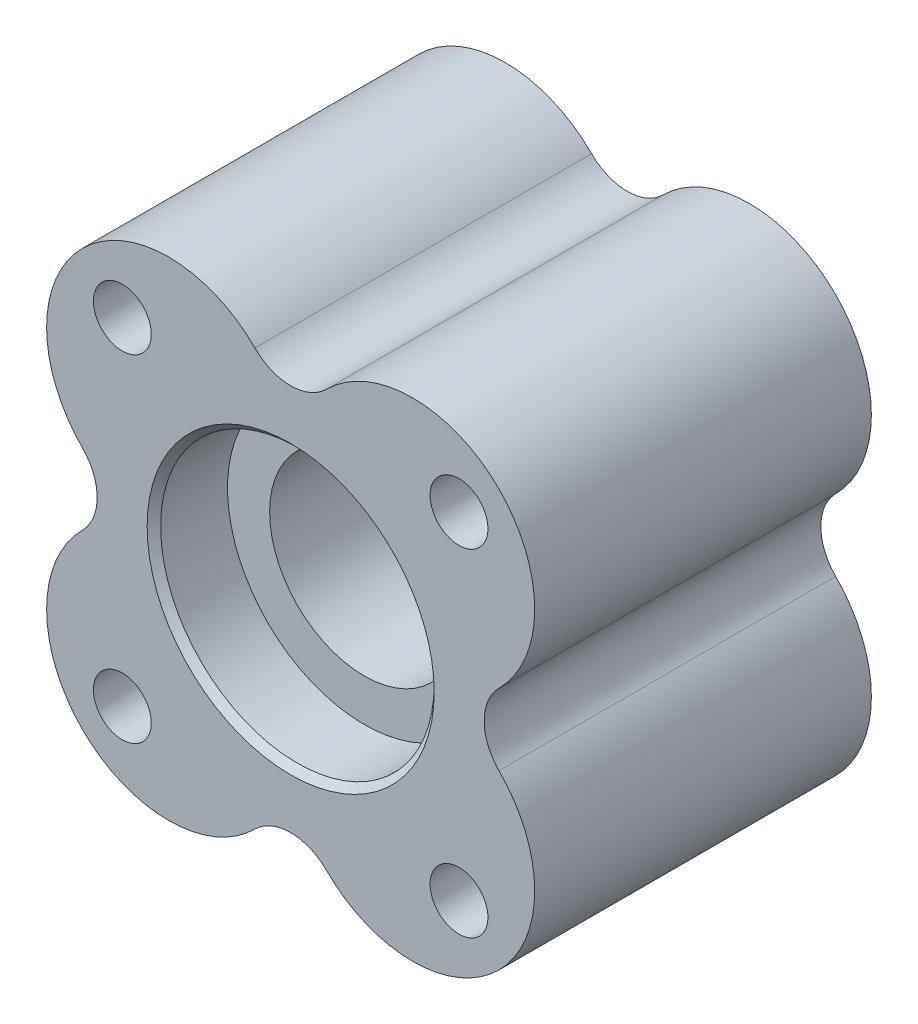
ISO-10303-21;
HEADER;
FILE_DESCRIPTION(('STEP AP214'),'2;1');
FILE_NAME('part.step','',(''),(''),'','','');
FILE_SCHEMA(('AUTOMOTIVE_DESIGN { 1 0 10303 214 1 1 1 1 }'));
ENDSEC;
DATA;
#1=APPLICATION_CONTEXT('core data for automotive mechanical design processes');
#2=APPLICATION_PROTOCOL_DEFINITION('international standard','automotive_design',2000,#1);
#3=PRODUCT_CONTEXT('',#1,'mechanical');
#4=PRODUCT('Part','Part','',(#3));
#5=PRODUCT_RELATED_PRODUCT_CATEGORY('part','',(#4));
#6=PRODUCT_DEFINITION_FORMATION('','',#4);
#7=PRODUCT_DEFINITION_CONTEXT('part definition',#1,'design');
#8=PRODUCT_DEFINITION('design','',#6,#7);
#9=PRODUCT_DEFINITION_SHAPE('','',#8);
#10=(LENGTH_UNIT() NAMED_UNIT(*) SI_UNIT(.MILLI.,.METRE.));
#11=(NAMED_UNIT(*) PLANE_ANGLE_UNIT() SI_UNIT($,.RADIAN.));
#12=(NAMED_UNIT(*) SI_UNIT($,.STERADIAN.) SOLID_ANGLE_UNIT());
#13=UNCERTAINTY_MEASURE_WITH_UNIT(LENGTH_MEASURE(1.E-05),#10,'distance_accuracy_value','');
#14=(GEOMETRIC_REPRESENTATION_CONTEXT(3) GLOBAL_UNCERTAINTY_ASSIGNED_CONTEXT((#13)) GLOBAL_UNIT_ASSIGNED_CONTEXT((#10,
#11,#12)) REPRESENTATION_CONTEXT('',''));
#15=CARTESIAN_POINT('',(0.,0.,0.));
#16=DIRECTION('',(0.,0.,1.));
#17=DIRECTION('',(1.,0.,0.));
#18=AXIS2_PLACEMENT_3D('',#15,#16,#17);
#19=CARTESIAN_POINT('',(0.,0.,-25.4));
#20=DIRECTION('',(0.,0.,1.));
#21=DIRECTION('',(1.,0.,0.));
#22=AXIS2_PLACEMENT_3D('',#19,#20,#21);
#23=PLANE('',#22);
#24=CARTESIAN_POINT('',(25.4,25.4,-25.4));
#25=DIRECTION('',(0.,0.,-1.));
#26=DIRECTION('',(-1.,0.,0.));
#27=AXIS2_PLACEMENT_3D('',#24,#25,#26);
#28=CIRCLE('',#27,8.0645);
#29=CARTESIAN_POINT('',(17.3355,25.4,-25.4));
#30=VERTEX_POINT('',#29);
#31=EDGE_CURVE('E311',#30,#30,#28,.T.);
#32=ORIENTED_EDGE('',*,*,#31,.F.);
#33=EDGE_LOOP('',(#32));
#34=FACE_BOUND('',#33,.T.);
#35=CARTESIAN_POINT('',(-25.4,-25.4,-25.4));
#36=DIRECTION('',(0.,0.,-1.));
#37=DIRECTION('',(-1.,0.,0.));
#38=AXIS2_PLACEMENT_3D('',#35,#36,#37);
#39=CIRCLE('',#38,8.0645);
#40=CARTESIAN_POINT('',(-33.4645,-25.4,-25.4));
#41=VERTEX_POINT('',#40);
#42=EDGE_CURVE('E329',#41,#41,#39,.T.);
#43=ORIENTED_EDGE('',*,*,#42,.F.);
#44=EDGE_LOOP('',(#43));
#45=FACE_BOUND('',#44,.T.);
#46=CARTESIAN_POINT('',(0.,0.,-25.4));
#47=DIRECTION('',(0.,0.,1.));
#48=DIRECTION('',(1.,0.,0.));
#49=AXIS2_PLACEMENT_3D('',#46,#47,#48);
#50=CIRCLE('',#49,21.6535);
#51=CARTESIAN_POINT('',(21.6535,0.,-25.4));
#52=VERTEX_POINT('',#51);
#53=EDGE_CURVE('E48',#52,#52,#50,.T.);
#54=ORIENTED_EDGE('',*,*,#53,.T.);
#55=EDGE_LOOP('',(#54));
#56=FACE_BOUND('',#55,.T.);
#57=CARTESIAN_POINT('',(18.4117928474843,-18.4117928474839,-25.4));
#58=DIRECTION('',(0.,0.,1.));
#59=DIRECTION('',(0.,1.,0.));
#60=AXIS2_PLACEMENT_3D('',#57,#58,#59);
#61=CIRCLE('',#60,18.4117928474841);
#62=CARTESIAN_POINT('',(5.39268927122611,-31.430896423742,-25.4));
#63=VERTEX_POINT('',#62);
#64=CARTESIAN_POINT('',(31.4308964237421,-5.39268927122578,-25.4));
#65=VERTEX_POINT('',#64);
#66=EDGE_CURVE('E156',#63,#65,#61,.T.);
#67=ORIENTED_EDGE('',*,*,#66,.F.);
#68=CARTESIAN_POINT('',(0.,-36.8235856949681,-25.4));
#69=DIRECTION('',(0.,0.,-1.));
#70=DIRECTION('',(1.,0.,0.));
#71=AXIS2_PLACEMENT_3D('',#68,#69,#70);
#72=CIRCLE('',#71,7.62641430503184);
#73=CARTESIAN_POINT('',(-5.39268927122611,-31.430896423742,-25.4));
#74=VERTEX_POINT('',#73);
#75=EDGE_CURVE('E126',#74,#63,#72,.T.);
#76=ORIENTED_EDGE('',*,*,#75,.F.);
#77=CARTESIAN_POINT('',(-18.411792847484,-18.4117928474841,-25.4));
#78=DIRECTION('',(0.,0.,1.));
#79=DIRECTION('',(0.,1.,0.));
#80=AXIS2_PLACEMENT_3D('',#77,#78,#79);
#81=CIRCLE('',#80,18.4117928474841);
#82=CARTESIAN_POINT('',(-31.430896423742,-5.39268927122622,-25.4));
#83=VERTEX_POINT('',#82);
#84=EDGE_CURVE('E148',#83,#74,#81,.T.);
#85=ORIENTED_EDGE('',*,*,#84,.F.);
#86=CARTESIAN_POINT('',(-36.8235856949681,-1.28568862283272E-13,-25.4));
#87=DIRECTION('',(0.,0.,-1.));
#88=DIRECTION('',(0.,-1.,0.));
#89=AXIS2_PLACEMENT_3D('',#86,#87,#88);
#90=CIRCLE('',#89,7.62641430503184);
#91=CARTESIAN_POINT('',(-31.430896423742,5.392689271226,-25.4));
#92=VERTEX_POINT('',#91);
#93=EDGE_CURVE('E145',#92,#83,#90,.T.);
#94=ORIENTED_EDGE('',*,*,#93,.F.);
#95=CARTESIAN_POINT('',(-18.4117928474841,18.4117928474841,-25.4));
#96=DIRECTION('',(0.,0.,1.));
#97=DIRECTION('',(1.,0.,0.));
#98=AXIS2_PLACEMENT_3D('',#95,#96,#97);
#99=CIRCLE('',#98,18.4117928474841);
#100=CARTESIAN_POINT('',(-5.39268927122611,31.430896423742,-25.4));
#101=VERTEX_POINT('',#100);
#102=EDGE_CURVE('E172',#101,#92,#99,.T.);
#103=ORIENTED_EDGE('',*,*,#102,.F.);
#104=CARTESIAN_POINT('',(0.,36.8235856949681,-25.4));
#105=DIRECTION('',(0.,0.,-1.));
#106=DIRECTION('',(-1.,0.,0.));
#107=AXIS2_PLACEMENT_3D('',#104,#105,#106);
#108=CIRCLE('',#107,7.62641430503184);
#109=CARTESIAN_POINT('',(5.39268927122611,31.430896423742,-25.4));
#110=VERTEX_POINT('',#109);
#111=EDGE_CURVE('E170',#110,#101,#108,.T.);
#112=ORIENTED_EDGE('',*,*,#111,.F.);
#113=CARTESIAN_POINT('',(18.4117928474841,18.4117928474841,-25.4));
#114=DIRECTION('',(0.,0.,1.));
#115=DIRECTION('',(-1.,0.,0.));
#116=AXIS2_PLACEMENT_3D('',#113,#114,#115);
#117=CIRCLE('',#116,18.4117928474841);
#118=CARTESIAN_POINT('',(31.4308964237419,5.39268927122644,-25.4));
#119=VERTEX_POINT('',#118);
#120=EDGE_CURVE('E167',#119,#110,#117,.T.);
#121=ORIENTED_EDGE('',*,*,#120,.F.);
#122=CARTESIAN_POINT('',(36.8235856949681,3.85706586849816E-13,-25.4));
#123=DIRECTION('',(0.,0.,-1.));
#124=DIRECTION('',(0.,1.,0.));
#125=AXIS2_PLACEMENT_3D('',#122,#123,#124);
#126=CIRCLE('',#125,7.62641430503184);
#127=EDGE_CURVE('E158',#65,#119,#126,.T.);
#128=ORIENTED_EDGE('',*,*,#127,.F.);
#129=EDGE_LOOP('',(#67,#76,#85,#94,#103,#112,#121,#128));
#130=FACE_BOUND('',#129,.T.);
#131=CARTESIAN_POINT('',(25.4,-25.4,-25.4));
#132=DIRECTION('',(0.,0.,-1.));
#133=DIRECTION('',(-1.,0.,0.));
#134=AXIS2_PLACEMENT_3D('',#131,#132,#133);
#135=CIRCLE('',#134,8.0645);
#136=CARTESIAN_POINT('',(17.3355,-25.4,-25.4));
#137=VERTEX_POINT('',#136);
#138=EDGE_CURVE('E320',#137,#137,#135,.T.);
#139=ORIENTED_EDGE('',*,*,#138,.F.);
#140=EDGE_LOOP('',(#139));
#141=FACE_BOUND('',#140,.T.);
#142=CARTESIAN_POINT('',(-25.4,25.4,-25.4));
#143=DIRECTION('',(0.,0.,-1.));
#144=DIRECTION('',(-1.,0.,0.));
#145=AXIS2_PLACEMENT_3D('',#142,#143,#144);
#146=CIRCLE('',#145,8.0645);
#147=CARTESIAN_POINT('',(-33.4645,25.4,-25.4));
#148=VERTEX_POINT('',#147);
#149=EDGE_CURVE('E303',#148,#148,#146,.T.);
#150=ORIENTED_EDGE('',*,*,#149,.F.);
#151=EDGE_LOOP('',(#150));
#152=FACE_BOUND('',#151,.T.);
#153=ADVANCED_FACE('F40',(#34,#45,#56,#130,#141,#152),#23,.F.);
#154=CARTESIAN_POINT('',(0.,0.,25.4));
#155=DIRECTION('',(0.,0.,1.));
#156=DIRECTION('',(1.,0.,0.));
#157=AXIS2_PLACEMENT_3D('',#154,#155,#156);
#158=PLANE('',#157);
#159=CARTESIAN_POINT('',(25.4,-25.4,25.4));
#160=DIRECTION('',(0.,0.,-1.));
#161=DIRECTION('',(-1.,0.,0.));
#162=AXIS2_PLACEMENT_3D('',#159,#160,#161);
#163=CIRCLE('',#162,4.36498999999999);
#164=CARTESIAN_POINT('',(21.03501,-25.4,25.4));
#165=VERTEX_POINT('',#164);
#166=EDGE_CURVE('E326',#165,#165,#163,.T.);
#167=ORIENTED_EDGE('',*,*,#166,.T.);
#168=EDGE_LOOP('',(#167));
#169=FACE_BOUND('',#168,.T.);
#170=CARTESIAN_POINT('',(0.,-36.8235856949681,25.4));
#171=DIRECTION('',(0.,0.,1.));
#172=DIRECTION('',(1.,0.,0.));
#173=AXIS2_PLACEMENT_3D('',#170,#171,#172);
#174=CIRCLE('',#173,7.62641430503184);
#175=CARTESIAN_POINT('',(-5.39268927122611,-31.430896423742,25.4));
#176=VERTEX_POINT('',#175);
#177=CARTESIAN_POINT('',(5.3926892712261,-31.430896423742,25.4));
#178=VERTEX_POINT('',#177);
#179=EDGE_CURVE('E123',#176,#178,#174,.F.);
#180=ORIENTED_EDGE('',*,*,#179,.T.);
#181=CARTESIAN_POINT('',(18.4117928474843,-18.4117928474839,25.4));
#182=DIRECTION('',(0.,0.,1.));
#183=DIRECTION('',(1.,0.,0.));
#184=AXIS2_PLACEMENT_3D('',#181,#182,#183);
#185=CIRCLE('',#184,18.4117928474841);
#186=CARTESIAN_POINT('',(31.4308964237421,-5.39268927122578,25.4));
#187=VERTEX_POINT('',#186);
#188=EDGE_CURVE('E106',#178,#187,#185,.T.);
#189=ORIENTED_EDGE('',*,*,#188,.T.);
#190=CARTESIAN_POINT('',(36.8235856949681,3.85706586849816E-13,25.4));
#191=DIRECTION('',(0.,0.,1.));
#192=DIRECTION('',(1.,0.,0.));
#193=AXIS2_PLACEMENT_3D('',#190,#191,#192);
#194=CIRCLE('',#193,7.62641430503184);
#195=CARTESIAN_POINT('',(31.430896423742,5.39268927122643,25.4));
#196=VERTEX_POINT('',#195);
#197=EDGE_CURVE('E127',#187,#196,#194,.F.);
#198=ORIENTED_EDGE('',*,*,#197,.T.);
#199=CARTESIAN_POINT('',(18.4117928474841,18.4117928474841,25.4));
#200=DIRECTION('',(0.,0.,1.));
#201=DIRECTION('',(1.,0.,0.));
#202=AXIS2_PLACEMENT_3D('',#199,#200,#201);
#203=CIRCLE('',#202,18.4117928474841);
#204=CARTESIAN_POINT('',(5.39268927122611,31.430896423742,25.4));
#205=VERTEX_POINT('',#204);
#206=EDGE_CURVE('E176',#196,#205,#203,.T.);
#207=ORIENTED_EDGE('',*,*,#206,.T.);
#208=CARTESIAN_POINT('',(0.,36.8235856949681,25.4));
#209=DIRECTION('',(0.,0.,1.));
#210=DIRECTION('',(1.,0.,0.));
#211=AXIS2_PLACEMENT_3D('',#208,#209,#210);
#212=CIRCLE('',#211,7.62641430503184);
#213=CARTESIAN_POINT('',(-5.3926892712261,31.430896423742,25.4));
#214=VERTEX_POINT('',#213);
#215=EDGE_CURVE('E55',#205,#214,#212,.F.);
#216=ORIENTED_EDGE('',*,*,#215,.T.);
#217=CARTESIAN_POINT('',(-18.4117928474841,18.4117928474841,25.4));
#218=DIRECTION('',(0.,0.,1.));
#219=DIRECTION('',(1.,0.,0.));
#220=AXIS2_PLACEMENT_3D('',#217,#218,#219);
#221=CIRCLE('',#220,18.4117928474841);
#222=CARTESIAN_POINT('',(-31.430896423742,5.392689271226,25.4));
#223=VERTEX_POINT('',#222);
#224=EDGE_CURVE('E165',#214,#223,#221,.T.);
#225=ORIENTED_EDGE('',*,*,#224,.T.);
#226=CARTESIAN_POINT('',(-36.8235856949681,-1.28568862283272E-13,25.4));
#227=DIRECTION('',(0.,0.,1.));
#228=DIRECTION('',(1.,0.,0.));
#229=AXIS2_PLACEMENT_3D('',#226,#227,#228);
#230=CIRCLE('',#229,7.62641430503184);
#231=CARTESIAN_POINT('',(-31.430896423742,-5.39268927122621,25.4));
#232=VERTEX_POINT('',#231);
#233=EDGE_CURVE('E116',#223,#232,#230,.F.);
#234=ORIENTED_EDGE('',*,*,#233,.T.);
#235=CARTESIAN_POINT('',(-18.411792847484,-18.4117928474841,25.4));
#236=DIRECTION('',(0.,0.,1.));
#237=DIRECTION('',(1.,0.,0.));
#238=AXIS2_PLACEMENT_3D('',#235,#236,#237);
#239=CIRCLE('',#238,18.4117928474841);
#240=EDGE_CURVE('E133',#232,#176,#239,.T.);
#241=ORIENTED_EDGE('',*,*,#240,.T.);
#242=EDGE_LOOP('',(#180,#189,#198,#207,#216,#225,#234,#241));
#243=FACE_BOUND('',#242,.T.);
#244=CARTESIAN_POINT('',(0.,0.,25.4));
#245=DIRECTION('',(0.,0.,1.));
#246=DIRECTION('',(1.,0.,0.));
#247=AXIS2_PLACEMENT_3D('',#244,#245,#246);
#248=CIRCLE('',#247,21.6535);
#249=CARTESIAN_POINT('',(21.6535,0.,25.4));
#250=VERTEX_POINT('',#249);
#251=EDGE_CURVE('E195',#250,#250,#248,.F.);
#252=ORIENTED_EDGE('',*,*,#251,.T.);
#253=EDGE_LOOP('',(#252));
#254=FACE_BOUND('',#253,.T.);
#255=CARTESIAN_POINT('',(-25.4,-25.4,25.4));
#256=DIRECTION('',(0.,0.,-1.));
#257=DIRECTION('',(-1.,0.,0.));
#258=AXIS2_PLACEMENT_3D('',#255,#256,#257);
#259=CIRCLE('',#258,4.36498999999999);
#260=CARTESIAN_POINT('',(-29.76499,-25.4,25.4));
#261=VERTEX_POINT('',#260);
#262=EDGE_CURVE('E134',#261,#261,#259,.T.);
#263=ORIENTED_EDGE('',*,*,#262,.T.);
#264=EDGE_LOOP('',(#263));
#265=FACE_BOUND('',#264,.T.);
#266=CARTESIAN_POINT('',(25.4,25.4,25.4));
#267=DIRECTION('',(0.,0.,-1.));
#268=DIRECTION('',(-1.,0.,0.));
#269=AXIS2_PLACEMENT_3D('',#266,#267,#268);
#270=CIRCLE('',#269,4.36498999999999);
#271=CARTESIAN_POINT('',(21.03501,25.4,25.4));
#272=VERTEX_POINT('',#271);
#273=EDGE_CURVE('E317',#272,#272,#270,.T.);
#274=ORIENTED_EDGE('',*,*,#273,.T.);
#275=EDGE_LOOP('',(#274));
#276=FACE_BOUND('',#275,.T.);
#277=CARTESIAN_POINT('',(-25.4,25.4,25.4));
#278=DIRECTION('',(0.,0.,-1.));
#279=DIRECTION('',(-1.,0.,0.));
#280=AXIS2_PLACEMENT_3D('',#277,#278,#279);
#281=CIRCLE('',#280,4.36498999999999);
#282=CARTESIAN_POINT('',(-29.76499,25.4,25.4));
#283=VERTEX_POINT('',#282);
#284=EDGE_CURVE('E306',#283,#283,#281,.T.);
#285=ORIENTED_EDGE('',*,*,#284,.T.);
#286=EDGE_LOOP('',(#285));
#287=FACE_BOUND('',#286,.T.);
#288=ADVANCED_FACE('F130',(#169,#243,#254,#265,#276,#287),#158,.T.);
#289=CARTESIAN_POINT('',(0.,0.,25.4));
#290=DIRECTION('',(0.,0.,-1.));
#291=DIRECTION('',(-1.,0.,0.));
#292=AXIS2_PLACEMENT_3D('',#289,#290,#291);
#293=CYLINDRICAL_SURFACE('',#292,20.6375);
#294=CARTESIAN_POINT('',(0.,0.,-24.384));
#295=DIRECTION('',(0.,0.,1.));
#296=DIRECTION('',(1.,0.,0.));
#297=AXIS2_PLACEMENT_3D('',#294,#295,#296);
#298=CIRCLE('',#297,20.6375);
#299=CARTESIAN_POINT('',(20.6375,0.,-24.384));
#300=VERTEX_POINT('',#299);
#301=EDGE_CURVE('E12',#300,#300,#298,.F.);
#302=ORIENTED_EDGE('',*,*,#301,.T.);
#303=EDGE_LOOP('',(#302));
#304=FACE_BOUND('',#303,.T.);
#305=CARTESIAN_POINT('',(0.,0.,-14.2875));
#306=DIRECTION('',(0.,0.,1.));
#307=DIRECTION('',(1.,0.,0.));
#308=AXIS2_PLACEMENT_3D('',#305,#306,#307);
#309=CIRCLE('',#308,20.6375);
#310=CARTESIAN_POINT('',(20.6375,0.,-14.2875));
#311=VERTEX_POINT('',#310);
#312=EDGE_CURVE('E180',#311,#311,#309,.T.);
#313=ORIENTED_EDGE('',*,*,#312,.T.);
#314=EDGE_LOOP('',(#313));
#315=FACE_BOUND('',#314,.T.);
#316=ADVANCED_FACE('F221',(#304,#315),#293,.F.);
#317=CARTESIAN_POINT('',(0.,0.,24.3839999999999));
#318=DIRECTION('',(0.,0.,1.));
#319=DIRECTION('',(1.,0.,0.));
#320=AXIS2_PLACEMENT_3D('',#317,#318,#319);
#321=CIRCLE('',#320,20.6375);
#322=CARTESIAN_POINT('',(20.6375,0.,24.3839999999999));
#323=VERTEX_POINT('',#322);
#324=EDGE_CURVE('E192',#323,#323,#321,.T.);
#325=ORIENTED_EDGE('',*,*,#324,.T.);
#326=EDGE_LOOP('',(#325));
#327=FACE_BOUND('',#326,.T.);
#328=CARTESIAN_POINT('',(0.,0.,14.2875));
#329=DIRECTION('',(0.,0.,1.));
#330=DIRECTION('',(1.,0.,0.));
#331=AXIS2_PLACEMENT_3D('',#328,#329,#330);
#332=CIRCLE('',#331,20.6375);
#333=CARTESIAN_POINT('',(20.6375,0.,14.2875));
#334=VERTEX_POINT('',#333);
#335=EDGE_CURVE('E189',#334,#334,#332,.T.);
#336=ORIENTED_EDGE('',*,*,#335,.F.);
#337=EDGE_LOOP('',(#336));
#338=FACE_BOUND('',#337,.T.);
#339=ADVANCED_FACE('F227',(#327,#338),#293,.F.);
#340=CARTESIAN_POINT('',(0.,0.,83.7716647869495));
#341=DIRECTION('',(0.,0.,-1.));
#342=DIRECTION('',(-1.,0.,0.));
#343=AXIS2_PLACEMENT_3D('',#340,#341,#342);
#344=CYLINDRICAL_SURFACE('',#343,14.2875);
#345=CARTESIAN_POINT('',(0.,0.,14.2875));
#346=DIRECTION('',(0.,0.,1.));
#347=DIRECTION('',(1.,0.,0.));
#348=AXIS2_PLACEMENT_3D('',#345,#346,#347);
#349=CIRCLE('',#348,14.2875);
#350=CARTESIAN_POINT('',(14.2875,0.,14.2875));
#351=VERTEX_POINT('',#350);
#352=EDGE_CURVE('E186',#351,#351,#349,.T.);
#353=ORIENTED_EDGE('',*,*,#352,.T.);
#354=EDGE_LOOP('',(#353));
#355=FACE_BOUND('',#354,.T.);
#356=CARTESIAN_POINT('',(0.,0.,-14.2875));
#357=DIRECTION('',(0.,0.,1.));
#358=DIRECTION('',(1.,0.,0.));
#359=AXIS2_PLACEMENT_3D('',#356,#357,#358);
#360=CIRCLE('',#359,14.2875);
#361=CARTESIAN_POINT('',(14.2875,0.,-14.2875));
#362=VERTEX_POINT('',#361);
#363=EDGE_CURVE('E183',#362,#362,#360,.T.);
#364=ORIENTED_EDGE('',*,*,#363,.F.);
#365=EDGE_LOOP('',(#364));
#366=FACE_BOUND('',#365,.T.);
#367=ADVANCED_FACE('F230',(#355,#366),#344,.F.);
#368=CARTESIAN_POINT('',(0.,0.,14.2875));
#369=DIRECTION('',(0.,0.,1.));
#370=DIRECTION('',(1.,0.,0.));
#371=AXIS2_PLACEMENT_3D('',#368,#369,#370);
#372=PLANE('',#371);
#373=ORIENTED_EDGE('',*,*,#352,.F.);
#374=EDGE_LOOP('',(#373));
#375=FACE_BOUND('',#374,.T.);
#376=ORIENTED_EDGE('',*,*,#335,.T.);
#377=EDGE_LOOP('',(#376));
#378=FACE_BOUND('',#377,.T.);
#379=ADVANCED_FACE('F234',(#375,#378),#372,.T.);
#380=CARTESIAN_POINT('',(0.,0.,-14.2875));
#381=DIRECTION('',(0.,0.,1.));
#382=DIRECTION('',(1.,0.,0.));
#383=AXIS2_PLACEMENT_3D('',#380,#381,#382);
#384=PLANE('',#383);
#385=ORIENTED_EDGE('',*,*,#363,.T.);
#386=EDGE_LOOP('',(#385));
#387=FACE_BOUND('',#386,.T.);
#388=ORIENTED_EDGE('',*,*,#312,.F.);
#389=EDGE_LOOP('',(#388));
#390=FACE_BOUND('',#389,.T.);
#391=ADVANCED_FACE('F212',(#387,#390),#384,.F.);
#392=CARTESIAN_POINT('',(0.,0.,24.3839999999999));
#393=DIRECTION('',(0.,0.,1.));
#394=DIRECTION('',(1.,0.,0.));
#395=AXIS2_PLACEMENT_3D('',#392,#393,#394);
#396=CONICAL_SURFACE('',#395,20.6375,0.785398163397447);
#397=ORIENTED_EDGE('',*,*,#251,.F.);
#398=EDGE_LOOP('',(#397));
#399=FACE_BOUND('',#398,.T.);
#400=ORIENTED_EDGE('',*,*,#324,.F.);
#401=EDGE_LOOP('',(#400));
#402=FACE_BOUND('',#401,.T.);
#403=ADVANCED_FACE('F204',(#399,#402),#396,.F.);
#404=CARTESIAN_POINT('',(0.,0.,-25.4));
#405=DIRECTION('',(0.,0.,-1.));
#406=DIRECTION('',(-1.,0.,0.));
#407=AXIS2_PLACEMENT_3D('',#404,#405,#406);
#408=CONICAL_SURFACE('',#407,21.6535,0.78539816339745);
#409=ORIENTED_EDGE('',*,*,#301,.F.);
#410=EDGE_LOOP('',(#409));
#411=FACE_BOUND('',#410,.T.);
#412=ORIENTED_EDGE('',*,*,#53,.F.);
#413=EDGE_LOOP('',(#412));
#414=FACE_BOUND('',#413,.T.);
#415=ADVANCED_FACE('F42',(#411,#414),#408,.F.);
#416=CARTESIAN_POINT('',(-18.4117928474841,18.4117928474841,25.401));
#417=DIRECTION('',(0.,0.,-1.));
#418=DIRECTION('',(-1.,0.,0.));
#419=AXIS2_PLACEMENT_3D('',#416,#417,#418);
#420=CYLINDRICAL_SURFACE('',#419,18.4117928474841);
#421=DIRECTION('',(0.,0.,-1.));
#422=VECTOR('',#421,1.);
#423=CARTESIAN_POINT('',(-5.39268927122611,31.430896423742,25.401));
#424=LINE('',#423,#422);
#425=EDGE_CURVE('E62',#214,#101,#424,.T.);
#426=ORIENTED_EDGE('',*,*,#425,.T.);
#427=ORIENTED_EDGE('',*,*,#102,.T.);
#428=DIRECTION('',(0.,0.,-1.));
#429=VECTOR('',#428,1.);
#430=CARTESIAN_POINT('',(-31.430896423742,5.392689271226,25.401));
#431=LINE('',#430,#429);
#432=EDGE_CURVE('E150',#223,#92,#431,.T.);
#433=ORIENTED_EDGE('',*,*,#432,.F.);
#434=ORIENTED_EDGE('',*,*,#224,.F.);
#435=EDGE_LOOP('',(#426,#427,#433,#434));
#436=FACE_BOUND('',#435,.T.);
#437=ADVANCED_FACE('F203',(#436),#420,.T.);
#438=CARTESIAN_POINT('',(0.,36.8235856949681,25.401));
#439=DIRECTION('',(0.,0.,-1.));
#440=DIRECTION('',(-1.,0.,0.));
#441=AXIS2_PLACEMENT_3D('',#438,#439,#440);
#442=CYLINDRICAL_SURFACE('',#441,7.62641430503184);
#443=DIRECTION('',(0.,0.,-1.));
#444=VECTOR('',#443,1.);
#445=CARTESIAN_POINT('',(5.39268927122611,31.430896423742,25.401));
#446=LINE('',#445,#444);
#447=EDGE_CURVE('E174',#205,#110,#446,.T.);
#448=ORIENTED_EDGE('',*,*,#447,.T.);
#449=ORIENTED_EDGE('',*,*,#111,.T.);
#450=ORIENTED_EDGE('',*,*,#425,.F.);
#451=ORIENTED_EDGE('',*,*,#215,.F.);
#452=EDGE_LOOP('',(#448,#449,#450,#451));
#453=FACE_BOUND('',#452,.T.);
#454=ADVANCED_FACE('F210',(#453),#442,.F.);
#455=CARTESIAN_POINT('',(18.4117928474841,18.4117928474841,25.401));
#456=DIRECTION('',(0.,0.,-1.));
#457=DIRECTION('',(-1.,0.,0.));
#458=AXIS2_PLACEMENT_3D('',#455,#456,#457);
#459=CYLINDRICAL_SURFACE('',#458,18.4117928474841);
#460=ORIENTED_EDGE('',*,*,#206,.F.);
#461=DIRECTION('',(0.,0.,-1.));
#462=VECTOR('',#461,1.);
#463=CARTESIAN_POINT('',(31.4308964237419,5.39268927122644,25.401));
#464=LINE('',#463,#462);
#465=EDGE_CURVE('E117',#196,#119,#464,.T.);
#466=ORIENTED_EDGE('',*,*,#465,.T.);
#467=ORIENTED_EDGE('',*,*,#120,.T.);
#468=ORIENTED_EDGE('',*,*,#447,.F.);
#469=EDGE_LOOP('',(#460,#466,#467,#468));
#470=FACE_BOUND('',#469,.T.);
#471=ADVANCED_FACE('F242',(#470),#459,.T.);
#472=CARTESIAN_POINT('',(36.8235856949681,3.85706586849816E-13,25.401));
#473=DIRECTION('',(0.,0.,-1.));
#474=DIRECTION('',(-1.,0.,0.));
#475=AXIS2_PLACEMENT_3D('',#472,#473,#474);
#476=CYLINDRICAL_SURFACE('',#475,7.62641430503184);
#477=DIRECTION('',(0.,0.,-1.));
#478=VECTOR('',#477,1.);
#479=CARTESIAN_POINT('',(31.4308964237421,-5.39268927122578,25.401));
#480=LINE('',#479,#478);
#481=EDGE_CURVE('E112',#187,#65,#480,.T.);
#482=ORIENTED_EDGE('',*,*,#481,.T.);
#483=ORIENTED_EDGE('',*,*,#127,.T.);
#484=ORIENTED_EDGE('',*,*,#465,.F.);
#485=ORIENTED_EDGE('',*,*,#197,.F.);
#486=EDGE_LOOP('',(#482,#483,#484,#485));
#487=FACE_BOUND('',#486,.T.);
#488=ADVANCED_FACE('F245',(#487),#476,.F.);
#489=CARTESIAN_POINT('',(18.4117928474843,-18.4117928474839,25.401));
#490=DIRECTION('',(0.,0.,-1.));
#491=DIRECTION('',(-1.,0.,0.));
#492=AXIS2_PLACEMENT_3D('',#489,#490,#491);
#493=CYLINDRICAL_SURFACE('',#492,18.4117928474841);
#494=ORIENTED_EDGE('',*,*,#188,.F.);
#495=DIRECTION('',(0.,0.,-1.));
#496=VECTOR('',#495,1.);
#497=CARTESIAN_POINT('',(5.39268927122611,-31.430896423742,25.401));
#498=LINE('',#497,#496);
#499=EDGE_CURVE('E110',#178,#63,#498,.T.);
#500=ORIENTED_EDGE('',*,*,#499,.T.);
#501=ORIENTED_EDGE('',*,*,#66,.T.);
#502=ORIENTED_EDGE('',*,*,#481,.F.);
#503=EDGE_LOOP('',(#494,#500,#501,#502));
#504=FACE_BOUND('',#503,.T.);
#505=ADVANCED_FACE('F108',(#504),#493,.T.);
#506=CARTESIAN_POINT('',(-18.411792847484,-18.4117928474841,25.401));
#507=DIRECTION('',(0.,0.,-1.));
#508=DIRECTION('',(-1.,0.,0.));
#509=AXIS2_PLACEMENT_3D('',#506,#507,#508);
#510=CYLINDRICAL_SURFACE('',#509,18.4117928474841);
#511=DIRECTION('',(0.,0.,-1.));
#512=VECTOR('',#511,1.);
#513=CARTESIAN_POINT('',(-31.430896423742,-5.39268927122622,25.401));
#514=LINE('',#513,#512);
#515=EDGE_CURVE('E151',#232,#83,#514,.T.);
#516=ORIENTED_EDGE('',*,*,#515,.T.);
#517=ORIENTED_EDGE('',*,*,#84,.T.);
#518=DIRECTION('',(0.,0.,-1.));
#519=VECTOR('',#518,1.);
#520=CARTESIAN_POINT('',(-5.39268927122611,-31.430896423742,25.401));
#521=LINE('',#520,#519);
#522=EDGE_CURVE('E128',#176,#74,#521,.T.);
#523=ORIENTED_EDGE('',*,*,#522,.F.);
#524=ORIENTED_EDGE('',*,*,#240,.F.);
#525=EDGE_LOOP('',(#516,#517,#523,#524));
#526=FACE_BOUND('',#525,.T.);
#527=ADVANCED_FACE('F251',(#526),#510,.T.);
#528=CARTESIAN_POINT('',(-36.8235856949681,-1.28568862283272E-13,25.401));
#529=DIRECTION('',(0.,0.,-1.));
#530=DIRECTION('',(-1.,0.,0.));
#531=AXIS2_PLACEMENT_3D('',#528,#529,#530);
#532=CYLINDRICAL_SURFACE('',#531,7.62641430503184);
#533=ORIENTED_EDGE('',*,*,#432,.T.);
#534=ORIENTED_EDGE('',*,*,#93,.T.);
#535=ORIENTED_EDGE('',*,*,#515,.F.);
#536=ORIENTED_EDGE('',*,*,#233,.F.);
#537=EDGE_LOOP('',(#533,#534,#535,#536));
#538=FACE_BOUND('',#537,.T.);
#539=ADVANCED_FACE('F255',(#538),#532,.F.);
#540=CARTESIAN_POINT('',(0.,-36.8235856949681,25.401));
#541=DIRECTION('',(0.,0.,-1.));
#542=DIRECTION('',(-1.,0.,0.));
#543=AXIS2_PLACEMENT_3D('',#540,#541,#542);
#544=CYLINDRICAL_SURFACE('',#543,7.62641430503184);
#545=ORIENTED_EDGE('',*,*,#522,.T.);
#546=ORIENTED_EDGE('',*,*,#75,.T.);
#547=ORIENTED_EDGE('',*,*,#499,.F.);
#548=ORIENTED_EDGE('',*,*,#179,.F.);
#549=EDGE_LOOP('',(#545,#546,#547,#548));
#550=FACE_BOUND('',#549,.T.);
#551=ADVANCED_FACE('F122',(#550),#544,.F.);
#552=CARTESIAN_POINT('',(-25.4,-25.4,-25.4));
#553=DIRECTION('',(0.,0.,-1.));
#554=DIRECTION('',(-1.,0.,0.));
#555=AXIS2_PLACEMENT_3D('',#552,#553,#554);
#556=CYLINDRICAL_SURFACE('',#555,4.36499);
#557=ORIENTED_EDGE('',*,*,#262,.F.);
#558=EDGE_LOOP('',(#557));
#559=FACE_BOUND('',#558,.T.);
#560=CARTESIAN_POINT('',(-25.4,-25.4,-22.2957425234633));
#561=DIRECTION('',(0.,0.,-1.));
#562=DIRECTION('',(-1.,0.,0.));
#563=AXIS2_PLACEMENT_3D('',#560,#561,#562);
#564=CIRCLE('',#563,4.36499);
#565=CARTESIAN_POINT('',(-29.76499,-25.4,-22.2957425234633));
#566=VERTEX_POINT('',#565);
#567=EDGE_CURVE('E138',#566,#566,#564,.T.);
#568=ORIENTED_EDGE('',*,*,#567,.T.);
#569=EDGE_LOOP('',(#568));
#570=FACE_BOUND('',#569,.T.);
#571=ADVANCED_FACE('F264',(#559,#570),#556,.F.);
#572=CARTESIAN_POINT('',(-25.4,-25.4,-25.4));
#573=DIRECTION('',(0.,0.,-1.));
#574=DIRECTION('',(-1.,0.,0.));
#575=AXIS2_PLACEMENT_3D('',#572,#573,#574);
#576=CONICAL_SURFACE('',#575,8.0645,0.872664625997164);
#577=ORIENTED_EDGE('',*,*,#567,.F.);
#578=EDGE_LOOP('',(#577));
#579=FACE_BOUND('',#578,.T.);
#580=ORIENTED_EDGE('',*,*,#42,.T.);
#581=EDGE_LOOP('',(#580));
#582=FACE_BOUND('',#581,.T.);
#583=ADVANCED_FACE('F267',(#579,#582),#576,.F.);
#584=CARTESIAN_POINT('',(25.4,-25.4,-25.4));
#585=DIRECTION('',(0.,0.,-1.));
#586=DIRECTION('',(-1.,0.,0.));
#587=AXIS2_PLACEMENT_3D('',#584,#585,#586);
#588=CYLINDRICAL_SURFACE('',#587,4.36499);
#589=ORIENTED_EDGE('',*,*,#166,.F.);
#590=EDGE_LOOP('',(#589));
#591=FACE_BOUND('',#590,.T.);
#592=CARTESIAN_POINT('',(25.4,-25.4,-22.2957425234633));
#593=DIRECTION('',(0.,0.,-1.));
#594=DIRECTION('',(-1.,0.,0.));
#595=AXIS2_PLACEMENT_3D('',#592,#593,#594);
#596=CIRCLE('',#595,4.36499);
#597=CARTESIAN_POINT('',(21.03501,-25.4,-22.2957425234633));
#598=VERTEX_POINT('',#597);
#599=EDGE_CURVE('E323',#598,#598,#596,.T.);
#600=ORIENTED_EDGE('',*,*,#599,.T.);
#601=EDGE_LOOP('',(#600));
#602=FACE_BOUND('',#601,.T.);
#603=ADVANCED_FACE('F271',(#591,#602),#588,.F.);
#604=CARTESIAN_POINT('',(25.4,-25.4,-25.4));
#605=DIRECTION('',(0.,0.,-1.));
#606=DIRECTION('',(-1.,0.,0.));
#607=AXIS2_PLACEMENT_3D('',#604,#605,#606);
#608=CONICAL_SURFACE('',#607,8.0645,0.872664625997165);
#609=ORIENTED_EDGE('',*,*,#599,.F.);
#610=EDGE_LOOP('',(#609));
#611=FACE_BOUND('',#610,.T.);
#612=ORIENTED_EDGE('',*,*,#138,.T.);
#613=EDGE_LOOP('',(#612));
#614=FACE_BOUND('',#613,.T.);
#615=ADVANCED_FACE('F275',(#611,#614),#608,.F.);
#616=CARTESIAN_POINT('',(25.4,25.4,-25.4));
#617=DIRECTION('',(0.,0.,-1.));
#618=DIRECTION('',(-1.,0.,0.));
#619=AXIS2_PLACEMENT_3D('',#616,#617,#618);
#620=CYLINDRICAL_SURFACE('',#619,4.36499);
#621=ORIENTED_EDGE('',*,*,#273,.F.);
#622=EDGE_LOOP('',(#621));
#623=FACE_BOUND('',#622,.T.);
#624=CARTESIAN_POINT('',(25.4,25.4,-22.2957425234633));
#625=DIRECTION('',(0.,0.,-1.));
#626=DIRECTION('',(-1.,0.,0.));
#627=AXIS2_PLACEMENT_3D('',#624,#625,#626);
#628=CIRCLE('',#627,4.36499);
#629=CARTESIAN_POINT('',(21.03501,25.4,-22.2957425234633));
#630=VERTEX_POINT('',#629);
#631=EDGE_CURVE('E314',#630,#630,#628,.T.);
#632=ORIENTED_EDGE('',*,*,#631,.T.);
#633=EDGE_LOOP('',(#632));
#634=FACE_BOUND('',#633,.T.);
#635=ADVANCED_FACE('F279',(#623,#634),#620,.F.);
#636=CARTESIAN_POINT('',(25.4,25.4,-25.4));
#637=DIRECTION('',(0.,0.,-1.));
#638=DIRECTION('',(-1.,0.,0.));
#639=AXIS2_PLACEMENT_3D('',#636,#637,#638);
#640=CONICAL_SURFACE('',#639,8.0645,0.872664625997164);
#641=ORIENTED_EDGE('',*,*,#631,.F.);
#642=EDGE_LOOP('',(#641));
#643=FACE_BOUND('',#642,.T.);
#644=ORIENTED_EDGE('',*,*,#31,.T.);
#645=EDGE_LOOP('',(#644));
#646=FACE_BOUND('',#645,.T.);
#647=ADVANCED_FACE('F283',(#643,#646),#640,.F.);
#648=CARTESIAN_POINT('',(-25.4,25.4,-25.4));
#649=DIRECTION('',(0.,0.,-1.));
#650=DIRECTION('',(-1.,0.,0.));
#651=AXIS2_PLACEMENT_3D('',#648,#649,#650);
#652=CYLINDRICAL_SURFACE('',#651,4.36499);
#653=ORIENTED_EDGE('',*,*,#284,.F.);
#654=EDGE_LOOP('',(#653));
#655=FACE_BOUND('',#654,.T.);
#656=CARTESIAN_POINT('',(-25.4,25.4,-22.2957425234633));
#657=DIRECTION('',(0.,0.,-1.));
#658=DIRECTION('',(-1.,0.,0.));
#659=AXIS2_PLACEMENT_3D('',#656,#657,#658);
#660=CIRCLE('',#659,4.36499);
#661=CARTESIAN_POINT('',(-29.76499,25.4,-22.2957425234633));
#662=VERTEX_POINT('',#661);
#663=EDGE_CURVE('E300',#662,#662,#660,.T.);
#664=ORIENTED_EDGE('',*,*,#663,.T.);
#665=EDGE_LOOP('',(#664));
#666=FACE_BOUND('',#665,.T.);
#667=ADVANCED_FACE('F287',(#655,#666),#652,.F.);
#668=CARTESIAN_POINT('',(-25.4,25.4,-25.4));
#669=DIRECTION('',(0.,0.,-1.));
#670=DIRECTION('',(-1.,0.,0.));
#671=AXIS2_PLACEMENT_3D('',#668,#669,#670);
#672=CONICAL_SURFACE('',#671,8.0645,0.872664625997164);
#673=ORIENTED_EDGE('',*,*,#663,.F.);
#674=EDGE_LOOP('',(#673));
#675=FACE_BOUND('',#674,.T.);
#676=ORIENTED_EDGE('',*,*,#149,.T.);
#677=EDGE_LOOP('',(#676));
#678=FACE_BOUND('',#677,.T.);
#679=ADVANCED_FACE('F291',(#675,#678),#672,.F.);
#680=CLOSED_SHELL('',(#153,#288,#316,#339,#367,#379,#391,#403,#415,#437,#454,#471,#488,#505,
#527,#539,#551,#571,#583,#603,#615,#635,#647,#667,#679));
#681=MANIFOLD_SOLID_BREP('B2',#680);
#682=ADVANCED_BREP_SHAPE_REPRESENTATION('',(#18,#681),#14);
#683=SHAPE_DEFINITION_REPRESENTATION(#9,#682);
ENDSEC;
END-ISO-10303-21;
